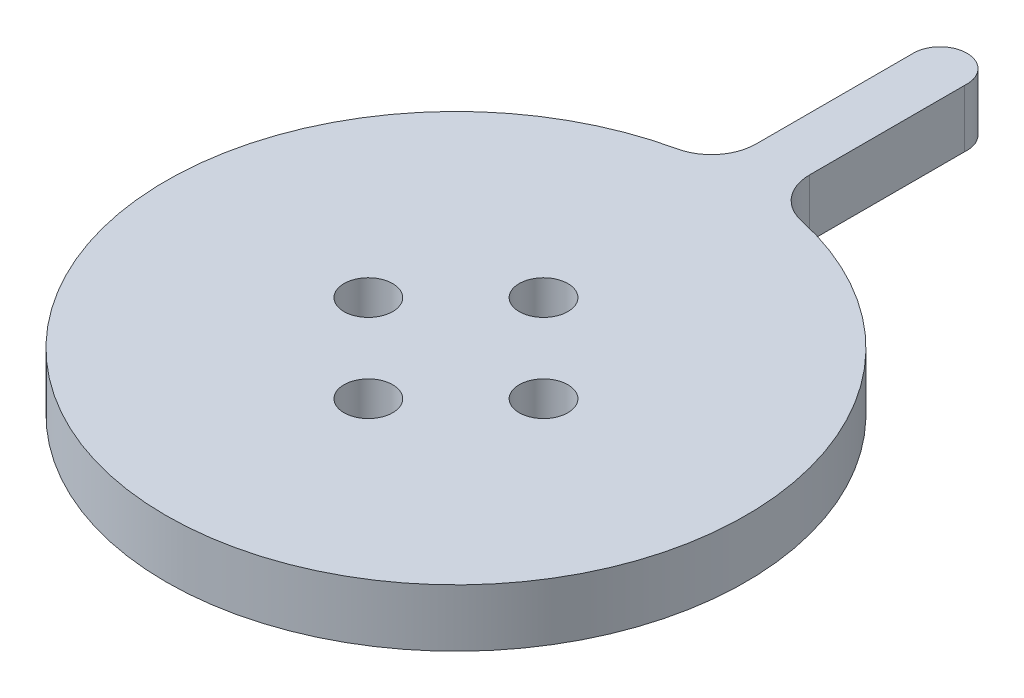
ISO-10303-21;
HEADER;
FILE_DESCRIPTION(('STEP AP214'),'2;1');
FILE_NAME('part.step','',(''),(''),'','','');
FILE_SCHEMA(('AUTOMOTIVE_DESIGN { 1 0 10303 214 1 1 1 1 }'));
ENDSEC;
DATA;
#1=APPLICATION_CONTEXT('core data for automotive mechanical design processes');
#2=APPLICATION_PROTOCOL_DEFINITION('international standard','automotive_design',2000,#1);
#3=PRODUCT_CONTEXT('',#1,'mechanical');
#4=PRODUCT('Part','Part','',(#3));
#5=PRODUCT_RELATED_PRODUCT_CATEGORY('part','',(#4));
#6=PRODUCT_DEFINITION_FORMATION('','',#4);
#7=PRODUCT_DEFINITION_CONTEXT('part definition',#1,'design');
#8=PRODUCT_DEFINITION('design','',#6,#7);
#9=PRODUCT_DEFINITION_SHAPE('','',#8);
#10=(LENGTH_UNIT() NAMED_UNIT(*) SI_UNIT(.MILLI.,.METRE.));
#11=(NAMED_UNIT(*) PLANE_ANGLE_UNIT() SI_UNIT($,.RADIAN.));
#12=(NAMED_UNIT(*) SI_UNIT($,.STERADIAN.) SOLID_ANGLE_UNIT());
#13=UNCERTAINTY_MEASURE_WITH_UNIT(LENGTH_MEASURE(1.E-05),#10,'distance_accuracy_value','');
#14=(GEOMETRIC_REPRESENTATION_CONTEXT(3) GLOBAL_UNCERTAINTY_ASSIGNED_CONTEXT((#13)) GLOBAL_UNIT_ASSIGNED_CONTEXT((#10,
#11,#12)) REPRESENTATION_CONTEXT('',''));
#15=CARTESIAN_POINT('',(0.,0.,0.));
#16=DIRECTION('',(0.,0.,1.));
#17=DIRECTION('',(1.,0.,0.));
#18=AXIS2_PLACEMENT_3D('',#15,#16,#17);
#19=CARTESIAN_POINT('',(0.,5.,0.));
#20=DIRECTION('',(0.,-1.,0.));
#21=DIRECTION('',(0.,0.,-1.));
#22=AXIS2_PLACEMENT_3D('',#19,#20,#21);
#23=CYLINDRICAL_SURFACE('',#22,32.76798012);
#24=DIRECTION('',(0.,1.,0.));
#25=VECTOR('',#24,1.);
#26=CARTESIAN_POINT('',(-7.00000000000001,-1.5,-32.0115685517707));
#27=LINE('',#26,#25);
#28=CARTESIAN_POINT('',(-7.00000000000001,-1.5,-32.0115685517707));
#29=VERTEX_POINT('',#28);
#30=CARTESIAN_POINT('',(-7.00000000000001,5.,-32.0115685517707));
#31=VERTEX_POINT('',#30);
#32=EDGE_CURVE('E127',#29,#31,#27,.T.);
#33=ORIENTED_EDGE('',*,*,#32,.F.);
#34=CARTESIAN_POINT('',(0.,-1.5,0.));
#35=DIRECTION('',(0.,-1.,0.));
#36=DIRECTION('',(0.,0.,-1.));
#37=AXIS2_PLACEMENT_3D('',#34,#35,#36);
#38=CIRCLE('',#37,32.76798012);
#39=CARTESIAN_POINT('',(7.,-1.5,-32.0115685517707));
#40=VERTEX_POINT('',#39);
#41=EDGE_CURVE('E49',#40,#29,#38,.T.);
#42=ORIENTED_EDGE('',*,*,#41,.F.);
#43=DIRECTION('',(0.,1.,0.));
#44=VECTOR('',#43,1.);
#45=CARTESIAN_POINT('',(7.,-1.5,-32.0115685517707));
#46=LINE('',#45,#44);
#47=CARTESIAN_POINT('',(7.,5.,-32.0115685517707));
#48=VERTEX_POINT('',#47);
#49=EDGE_CURVE('E144',#40,#48,#46,.T.);
#50=ORIENTED_EDGE('',*,*,#49,.T.);
#51=CARTESIAN_POINT('',(0.,5.,0.));
#52=DIRECTION('',(0.,1.,0.));
#53=DIRECTION('',(0.,0.,1.));
#54=AXIS2_PLACEMENT_3D('',#51,#52,#53);
#55=CIRCLE('',#54,32.76798012);
#56=EDGE_CURVE('E11',#31,#48,#55,.T.);
#57=ORIENTED_EDGE('',*,*,#56,.F.);
#58=EDGE_LOOP('',(#33,#42,#50,#57));
#59=FACE_BOUND('',#58,.T.);
#60=ADVANCED_FACE('F41',(#59),#23,.T.);
#61=CARTESIAN_POINT('',(0.,5.,0.));
#62=DIRECTION('',(0.,1.,0.));
#63=DIRECTION('',(0.,0.,1.));
#64=AXIS2_PLACEMENT_3D('',#61,#62,#63);
#65=PLANE('',#64);
#66=CARTESIAN_POINT('',(0.,5.,9.9));
#67=DIRECTION('',(0.,1.,0.));
#68=DIRECTION('',(0.,0.,1.));
#69=AXIS2_PLACEMENT_3D('',#66,#67,#68);
#70=CIRCLE('',#69,2.75);
#71=CARTESIAN_POINT('',(0.,5.,12.65));
#72=VERTEX_POINT('',#71);
#73=EDGE_CURVE('E148',#72,#72,#70,.T.);
#74=ORIENTED_EDGE('',*,*,#73,.F.);
#75=EDGE_LOOP('',(#74));
#76=FACE_BOUND('',#75,.T.);
#77=CARTESIAN_POINT('',(-9.9,5.,0.));
#78=DIRECTION('',(0.,1.,0.));
#79=DIRECTION('',(0.,0.,1.));
#80=AXIS2_PLACEMENT_3D('',#77,#78,#79);
#81=CIRCLE('',#80,2.75);
#82=CARTESIAN_POINT('',(-9.9,5.,2.75));
#83=VERTEX_POINT('',#82);
#84=EDGE_CURVE('E152',#83,#83,#81,.T.);
#85=ORIENTED_EDGE('',*,*,#84,.F.);
#86=EDGE_LOOP('',(#85));
#87=FACE_BOUND('',#86,.T.);
#88=CARTESIAN_POINT('',(0.,5.,-9.8994949));
#89=DIRECTION('',(0.,1.,0.));
#90=DIRECTION('',(0.,0.,1.));
#91=AXIS2_PLACEMENT_3D('',#88,#89,#90);
#92=CIRCLE('',#91,2.75);
#93=CARTESIAN_POINT('',(0.,5.,-7.1494949));
#94=VERTEX_POINT('',#93);
#95=EDGE_CURVE('E155',#94,#94,#92,.T.);
#96=ORIENTED_EDGE('',*,*,#95,.F.);
#97=EDGE_LOOP('',(#96));
#98=FACE_BOUND('',#97,.T.);
#99=CARTESIAN_POINT('',(9.9,5.,0.));
#100=DIRECTION('',(0.,1.,0.));
#101=DIRECTION('',(0.,0.,1.));
#102=AXIS2_PLACEMENT_3D('',#99,#100,#101);
#103=CIRCLE('',#102,2.75);
#104=CARTESIAN_POINT('',(9.9,5.,2.75));
#105=VERTEX_POINT('',#104);
#106=EDGE_CURVE('E141',#105,#105,#103,.T.);
#107=ORIENTED_EDGE('',*,*,#106,.F.);
#108=EDGE_LOOP('',(#107));
#109=FACE_BOUND('',#108,.T.);
#110=ORIENTED_EDGE('',*,*,#56,.T.);
#111=CARTESIAN_POINT('',(8.08025891692068,5.,-36.9516803192947));
#112=DIRECTION('',(0.,-1.,0.));
#113=DIRECTION('',(0.,0.,-1.));
#114=AXIS2_PLACEMENT_3D('',#111,#112,#113);
#115=CIRCLE('',#114,5.05684324487285);
#116=CARTESIAN_POINT('',(3.02341567204783,5.,-36.9516803192948));
#117=VERTEX_POINT('',#116);
#118=EDGE_CURVE('E131',#48,#117,#115,.T.);
#119=ORIENTED_EDGE('',*,*,#118,.T.);
#120=DIRECTION('',(0.,0.,-1.));
#121=VECTOR('',#120,1.);
#122=CARTESIAN_POINT('',(3.02341567204783,5.,-54.4772099219206));
#123=LINE('',#122,#121);
#124=CARTESIAN_POINT('',(3.02341567204783,5.,-54.4772099219206));
#125=VERTEX_POINT('',#124);
#126=EDGE_CURVE('E134',#117,#125,#123,.T.);
#127=ORIENTED_EDGE('',*,*,#126,.T.);
#128=CARTESIAN_POINT('',(0.,5.,-54.7144451206077));
#129=DIRECTION('',(0.,1.,0.));
#130=DIRECTION('',(0.,0.,1.));
#131=AXIS2_PLACEMENT_3D('',#128,#129,#130);
#132=CIRCLE('',#131,3.03270883295454);
#133=CARTESIAN_POINT('',(-3.02341567204783,5.,-54.9516803192947));
#134=VERTEX_POINT('',#133);
#135=EDGE_CURVE('E108',#125,#134,#132,.T.);
#136=ORIENTED_EDGE('',*,*,#135,.T.);
#137=DIRECTION('',(0.,0.,1.));
#138=VECTOR('',#137,1.);
#139=CARTESIAN_POINT('',(-3.02341567204783,5.,-36.9516803192947));
#140=LINE('',#139,#138);
#141=CARTESIAN_POINT('',(-3.02341567204783,5.,-36.9516803192947));
#142=VERTEX_POINT('',#141);
#143=EDGE_CURVE('E137',#134,#142,#140,.T.);
#144=ORIENTED_EDGE('',*,*,#143,.T.);
#145=CARTESIAN_POINT('',(-8.08025891692068,5.,-36.9516803192948));
#146=DIRECTION('',(0.,-1.,0.));
#147=DIRECTION('',(0.,0.,1.));
#148=AXIS2_PLACEMENT_3D('',#145,#146,#147);
#149=CIRCLE('',#148,5.05684324487285);
#150=EDGE_CURVE('E128',#142,#31,#149,.T.);
#151=ORIENTED_EDGE('',*,*,#150,.T.);
#152=EDGE_LOOP('',(#110,#119,#127,#136,#144,#151));
#153=FACE_BOUND('',#152,.T.);
#154=ADVANCED_FACE('F196',(#76,#87,#98,#109,#153),#65,.T.);
#155=CARTESIAN_POINT('',(0.,-1.5,0.));
#156=DIRECTION('',(0.,-1.,0.));
#157=DIRECTION('',(0.,0.,-1.));
#158=AXIS2_PLACEMENT_3D('',#155,#156,#157);
#159=PLANE('',#158);
#160=ORIENTED_EDGE('',*,*,#41,.T.);
#161=CARTESIAN_POINT('',(-8.08025891692068,-1.5,-36.9516803192948));
#162=DIRECTION('',(0.,-1.,0.));
#163=DIRECTION('',(0.,0.,1.));
#164=AXIS2_PLACEMENT_3D('',#161,#162,#163);
#165=CIRCLE('',#164,5.05684324487285);
#166=CARTESIAN_POINT('',(-3.02341567204783,-1.5,-36.9516803192947));
#167=VERTEX_POINT('',#166);
#168=EDGE_CURVE('E94',#167,#29,#165,.T.);
#169=ORIENTED_EDGE('',*,*,#168,.F.);
#170=DIRECTION('',(0.,0.,1.));
#171=VECTOR('',#170,1.);
#172=CARTESIAN_POINT('',(-3.02341567204783,-1.5,-36.9516803192947));
#173=LINE('',#172,#171);
#174=CARTESIAN_POINT('',(-3.02341567204783,-1.5,-54.9516803192947));
#175=VERTEX_POINT('',#174);
#176=EDGE_CURVE('E119',#175,#167,#173,.T.);
#177=ORIENTED_EDGE('',*,*,#176,.F.);
#178=CARTESIAN_POINT('',(0.,-1.5,-54.7144451206077));
#179=DIRECTION('',(0.,1.,0.));
#180=DIRECTION('',(0.,0.,1.));
#181=AXIS2_PLACEMENT_3D('',#178,#179,#180);
#182=CIRCLE('',#181,3.03270883295454);
#183=CARTESIAN_POINT('',(3.02341567204783,-1.5,-54.4772099219206));
#184=VERTEX_POINT('',#183);
#185=EDGE_CURVE('E105',#184,#175,#182,.T.);
#186=ORIENTED_EDGE('',*,*,#185,.F.);
#187=DIRECTION('',(0.,0.,-1.));
#188=VECTOR('',#187,1.);
#189=CARTESIAN_POINT('',(3.02341567204783,-1.5,-54.4772099219206));
#190=LINE('',#189,#188);
#191=CARTESIAN_POINT('',(3.02341567204783,-1.5,-36.9516803192948));
#192=VERTEX_POINT('',#191);
#193=EDGE_CURVE('E118',#192,#184,#190,.T.);
#194=ORIENTED_EDGE('',*,*,#193,.F.);
#195=CARTESIAN_POINT('',(8.08025891692068,-1.5,-36.9516803192947));
#196=DIRECTION('',(0.,-1.,0.));
#197=DIRECTION('',(0.,0.,-1.));
#198=AXIS2_PLACEMENT_3D('',#195,#196,#197);
#199=CIRCLE('',#198,5.05684324487285);
#200=EDGE_CURVE('E57',#40,#192,#199,.T.);
#201=ORIENTED_EDGE('',*,*,#200,.F.);
#202=EDGE_LOOP('',(#160,#169,#177,#186,#194,#201));
#203=FACE_BOUND('',#202,.T.);
#204=CARTESIAN_POINT('',(0.,-1.5,0.));
#205=DIRECTION('',(0.,-1.,0.));
#206=DIRECTION('',(0.,0.,-1.));
#207=AXIS2_PLACEMENT_3D('',#204,#205,#206);
#208=CIRCLE('',#207,30.26798012);
#209=CARTESIAN_POINT('',(0.,-1.5,-30.26798012));
#210=VERTEX_POINT('',#209);
#211=EDGE_CURVE('E160',#210,#210,#208,.T.);
#212=ORIENTED_EDGE('',*,*,#211,.F.);
#213=EDGE_LOOP('',(#212));
#214=FACE_BOUND('',#213,.T.);
#215=ADVANCED_FACE('F116',(#203,#214),#159,.T.);
#216=CARTESIAN_POINT('',(0.,-1.5,0.));
#217=DIRECTION('',(0.,1.,0.));
#218=DIRECTION('',(0.,0.,1.));
#219=AXIS2_PLACEMENT_3D('',#216,#217,#218);
#220=CYLINDRICAL_SURFACE('',#219,30.26798012);
#221=ORIENTED_EDGE('',*,*,#211,.T.);
#222=EDGE_LOOP('',(#221));
#223=FACE_BOUND('',#222,.T.);
#224=CARTESIAN_POINT('',(0.,0.,0.));
#225=DIRECTION('',(0.,-1.,0.));
#226=DIRECTION('',(0.,0.,-1.));
#227=AXIS2_PLACEMENT_3D('',#224,#225,#226);
#228=CIRCLE('',#227,30.26798012);
#229=CARTESIAN_POINT('',(0.,0.,-30.26798012));
#230=VERTEX_POINT('',#229);
#231=EDGE_CURVE('E163',#230,#230,#228,.T.);
#232=ORIENTED_EDGE('',*,*,#231,.F.);
#233=EDGE_LOOP('',(#232));
#234=FACE_BOUND('',#233,.T.);
#235=ADVANCED_FACE('F282',(#223,#234),#220,.F.);
#236=CARTESIAN_POINT('',(0.,0.,0.));
#237=DIRECTION('',(0.,1.,0.));
#238=DIRECTION('',(0.,0.,1.));
#239=AXIS2_PLACEMENT_3D('',#236,#237,#238);
#240=PLANE('',#239);
#241=CARTESIAN_POINT('',(0.,0.,9.9));
#242=DIRECTION('',(0.,1.,0.));
#243=DIRECTION('',(0.,0.,1.));
#244=AXIS2_PLACEMENT_3D('',#241,#242,#243);
#245=CIRCLE('',#244,2.75);
#246=CARTESIAN_POINT('',(0.,0.,12.65));
#247=VERTEX_POINT('',#246);
#248=EDGE_CURVE('E44',#247,#247,#245,.T.);
#249=ORIENTED_EDGE('',*,*,#248,.T.);
#250=EDGE_LOOP('',(#249));
#251=FACE_BOUND('',#250,.T.);
#252=CARTESIAN_POINT('',(-9.9,0.,0.));
#253=DIRECTION('',(0.,1.,0.));
#254=DIRECTION('',(0.,0.,1.));
#255=AXIS2_PLACEMENT_3D('',#252,#253,#254);
#256=CIRCLE('',#255,2.75);
#257=CARTESIAN_POINT('',(-9.9,0.,2.75));
#258=VERTEX_POINT('',#257);
#259=EDGE_CURVE('E171',#258,#258,#256,.T.);
#260=ORIENTED_EDGE('',*,*,#259,.T.);
#261=EDGE_LOOP('',(#260));
#262=FACE_BOUND('',#261,.T.);
#263=CARTESIAN_POINT('',(0.,0.,-9.8994949));
#264=DIRECTION('',(0.,1.,0.));
#265=DIRECTION('',(0.,0.,1.));
#266=AXIS2_PLACEMENT_3D('',#263,#264,#265);
#267=CIRCLE('',#266,2.75);
#268=CARTESIAN_POINT('',(0.,0.,-7.1494949));
#269=VERTEX_POINT('',#268);
#270=EDGE_CURVE('E169',#269,#269,#267,.T.);
#271=ORIENTED_EDGE('',*,*,#270,.T.);
#272=EDGE_LOOP('',(#271));
#273=FACE_BOUND('',#272,.T.);
#274=CARTESIAN_POINT('',(9.9,0.,0.));
#275=DIRECTION('',(0.,1.,0.));
#276=DIRECTION('',(0.,0.,1.));
#277=AXIS2_PLACEMENT_3D('',#274,#275,#276);
#278=CIRCLE('',#277,2.75);
#279=CARTESIAN_POINT('',(9.9,0.,2.75));
#280=VERTEX_POINT('',#279);
#281=EDGE_CURVE('E151',#280,#280,#278,.T.);
#282=ORIENTED_EDGE('',*,*,#281,.T.);
#283=EDGE_LOOP('',(#282));
#284=FACE_BOUND('',#283,.T.);
#285=ORIENTED_EDGE('',*,*,#231,.T.);
#286=EDGE_LOOP('',(#285));
#287=FACE_BOUND('',#286,.T.);
#288=ADVANCED_FACE('F178',(#251,#262,#273,#284,#287),#240,.F.);
#289=CARTESIAN_POINT('',(9.9,-4.8994949,0.));
#290=DIRECTION('',(0.,1.,0.));
#291=DIRECTION('',(0.,0.,1.));
#292=AXIS2_PLACEMENT_3D('',#289,#290,#291);
#293=CYLINDRICAL_SURFACE('',#292,2.75);
#294=ORIENTED_EDGE('',*,*,#106,.T.);
#295=EDGE_LOOP('',(#294));
#296=FACE_BOUND('',#295,.T.);
#297=ORIENTED_EDGE('',*,*,#281,.F.);
#298=EDGE_LOOP('',(#297));
#299=FACE_BOUND('',#298,.T.);
#300=ADVANCED_FACE('F268',(#296,#299),#293,.F.);
#301=CARTESIAN_POINT('',(0.,-4.8994949,-9.8994949));
#302=DIRECTION('',(0.,1.,0.));
#303=DIRECTION('',(0.,0.,1.));
#304=AXIS2_PLACEMENT_3D('',#301,#302,#303);
#305=CYLINDRICAL_SURFACE('',#304,2.75);
#306=ORIENTED_EDGE('',*,*,#95,.T.);
#307=EDGE_LOOP('',(#306));
#308=FACE_BOUND('',#307,.T.);
#309=ORIENTED_EDGE('',*,*,#270,.F.);
#310=EDGE_LOOP('',(#309));
#311=FACE_BOUND('',#310,.T.);
#312=ADVANCED_FACE('F193',(#308,#311),#305,.F.);
#313=CARTESIAN_POINT('',(-9.9,-4.8994949,0.));
#314=DIRECTION('',(0.,1.,0.));
#315=DIRECTION('',(0.,0.,1.));
#316=AXIS2_PLACEMENT_3D('',#313,#314,#315);
#317=CYLINDRICAL_SURFACE('',#316,2.75);
#318=ORIENTED_EDGE('',*,*,#84,.T.);
#319=EDGE_LOOP('',(#318));
#320=FACE_BOUND('',#319,.T.);
#321=ORIENTED_EDGE('',*,*,#259,.F.);
#322=EDGE_LOOP('',(#321));
#323=FACE_BOUND('',#322,.T.);
#324=ADVANCED_FACE('F183',(#320,#323),#317,.F.);
#325=CARTESIAN_POINT('',(0.,-4.8994949,9.9));
#326=DIRECTION('',(0.,1.,0.));
#327=DIRECTION('',(0.,0.,1.));
#328=AXIS2_PLACEMENT_3D('',#325,#326,#327);
#329=CYLINDRICAL_SURFACE('',#328,2.75);
#330=ORIENTED_EDGE('',*,*,#73,.T.);
#331=EDGE_LOOP('',(#330));
#332=FACE_BOUND('',#331,.T.);
#333=ORIENTED_EDGE('',*,*,#248,.F.);
#334=EDGE_LOOP('',(#333));
#335=FACE_BOUND('',#334,.T.);
#336=ADVANCED_FACE('F180',(#332,#335),#329,.F.);
#337=CARTESIAN_POINT('',(-8.08025891692068,-1.5,-36.9516803192948));
#338=DIRECTION('',(0.,1.,0.));
#339=DIRECTION('',(0.,0.,1.));
#340=AXIS2_PLACEMENT_3D('',#337,#338,#339);
#341=CYLINDRICAL_SURFACE('',#340,5.05684324487285);
#342=ORIENTED_EDGE('',*,*,#150,.F.);
#343=DIRECTION('',(0.,1.,0.));
#344=VECTOR('',#343,1.);
#345=CARTESIAN_POINT('',(-3.02341567204783,-1.5,-36.9516803192947));
#346=LINE('',#345,#344);
#347=EDGE_CURVE('E66',#167,#142,#346,.T.);
#348=ORIENTED_EDGE('',*,*,#347,.F.);
#349=ORIENTED_EDGE('',*,*,#168,.T.);
#350=ORIENTED_EDGE('',*,*,#32,.T.);
#351=EDGE_LOOP('',(#342,#348,#349,#350));
#352=FACE_BOUND('',#351,.T.);
#353=ADVANCED_FACE('F182',(#352),#341,.F.);
#354=CARTESIAN_POINT('',(-3.02341567204783,-1.5,-36.9516803192947));
#355=DIRECTION('',(-1.,0.,0.));
#356=DIRECTION('',(0.,0.,1.));
#357=AXIS2_PLACEMENT_3D('',#354,#355,#356);
#358=PLANE('',#357);
#359=ORIENTED_EDGE('',*,*,#143,.F.);
#360=DIRECTION('',(0.,1.,0.));
#361=VECTOR('',#360,1.);
#362=CARTESIAN_POINT('',(-3.02341567204783,-1.5,-54.9516803192947));
#363=LINE('',#362,#361);
#364=EDGE_CURVE('E113',#175,#134,#363,.T.);
#365=ORIENTED_EDGE('',*,*,#364,.F.);
#366=ORIENTED_EDGE('',*,*,#176,.T.);
#367=ORIENTED_EDGE('',*,*,#347,.T.);
#368=EDGE_LOOP('',(#359,#365,#366,#367));
#369=FACE_BOUND('',#368,.T.);
#370=ADVANCED_FACE('F191',(#369),#358,.T.);
#371=CARTESIAN_POINT('',(0.,-1.5,-54.7144451206077));
#372=DIRECTION('',(0.,1.,0.));
#373=DIRECTION('',(0.,0.,1.));
#374=AXIS2_PLACEMENT_3D('',#371,#372,#373);
#375=CYLINDRICAL_SURFACE('',#374,3.03270883295454);
#376=ORIENTED_EDGE('',*,*,#135,.F.);
#377=DIRECTION('',(0.,1.,0.));
#378=VECTOR('',#377,1.);
#379=CARTESIAN_POINT('',(3.02341567204783,-1.5,-54.4772099219206));
#380=LINE('',#379,#378);
#381=EDGE_CURVE('E102',#184,#125,#380,.T.);
#382=ORIENTED_EDGE('',*,*,#381,.F.);
#383=ORIENTED_EDGE('',*,*,#185,.T.);
#384=ORIENTED_EDGE('',*,*,#364,.T.);
#385=EDGE_LOOP('',(#376,#382,#383,#384));
#386=FACE_BOUND('',#385,.T.);
#387=ADVANCED_FACE('F104',(#386),#375,.T.);
#388=CARTESIAN_POINT('',(3.02341567204783,-1.5,-54.4772099219206));
#389=DIRECTION('',(1.,0.,0.));
#390=DIRECTION('',(0.,0.,-1.));
#391=AXIS2_PLACEMENT_3D('',#388,#389,#390);
#392=PLANE('',#391);
#393=ORIENTED_EDGE('',*,*,#126,.F.);
#394=DIRECTION('',(0.,1.,0.));
#395=VECTOR('',#394,1.);
#396=CARTESIAN_POINT('',(3.02341567204783,-1.5,-36.9516803192948));
#397=LINE('',#396,#395);
#398=EDGE_CURVE('E114',#192,#117,#397,.T.);
#399=ORIENTED_EDGE('',*,*,#398,.F.);
#400=ORIENTED_EDGE('',*,*,#193,.T.);
#401=ORIENTED_EDGE('',*,*,#381,.T.);
#402=EDGE_LOOP('',(#393,#399,#400,#401));
#403=FACE_BOUND('',#402,.T.);
#404=ADVANCED_FACE('F121',(#403),#392,.T.);
#405=CARTESIAN_POINT('',(8.08025891692068,-1.5,-36.9516803192947));
#406=DIRECTION('',(0.,1.,0.));
#407=DIRECTION('',(0.,0.,1.));
#408=AXIS2_PLACEMENT_3D('',#405,#406,#407);
#409=CYLINDRICAL_SURFACE('',#408,5.05684324487285);
#410=ORIENTED_EDGE('',*,*,#118,.F.);
#411=ORIENTED_EDGE('',*,*,#49,.F.);
#412=ORIENTED_EDGE('',*,*,#200,.T.);
#413=ORIENTED_EDGE('',*,*,#398,.T.);
#414=EDGE_LOOP('',(#410,#411,#412,#413));
#415=FACE_BOUND('',#414,.T.);
#416=ADVANCED_FACE('F207',(#415),#409,.F.);
#417=CLOSED_SHELL('',(#60,#154,#215,#235,#288,#300,#312,#324,#336,#353,#370,#387,#404,#416));
#418=MANIFOLD_SOLID_BREP('B2',#417);
#419=ADVANCED_BREP_SHAPE_REPRESENTATION('',(#18,#418),#14);
#420=SHAPE_DEFINITION_REPRESENTATION(#9,#419);
ENDSEC;
END-ISO-10303-21;
